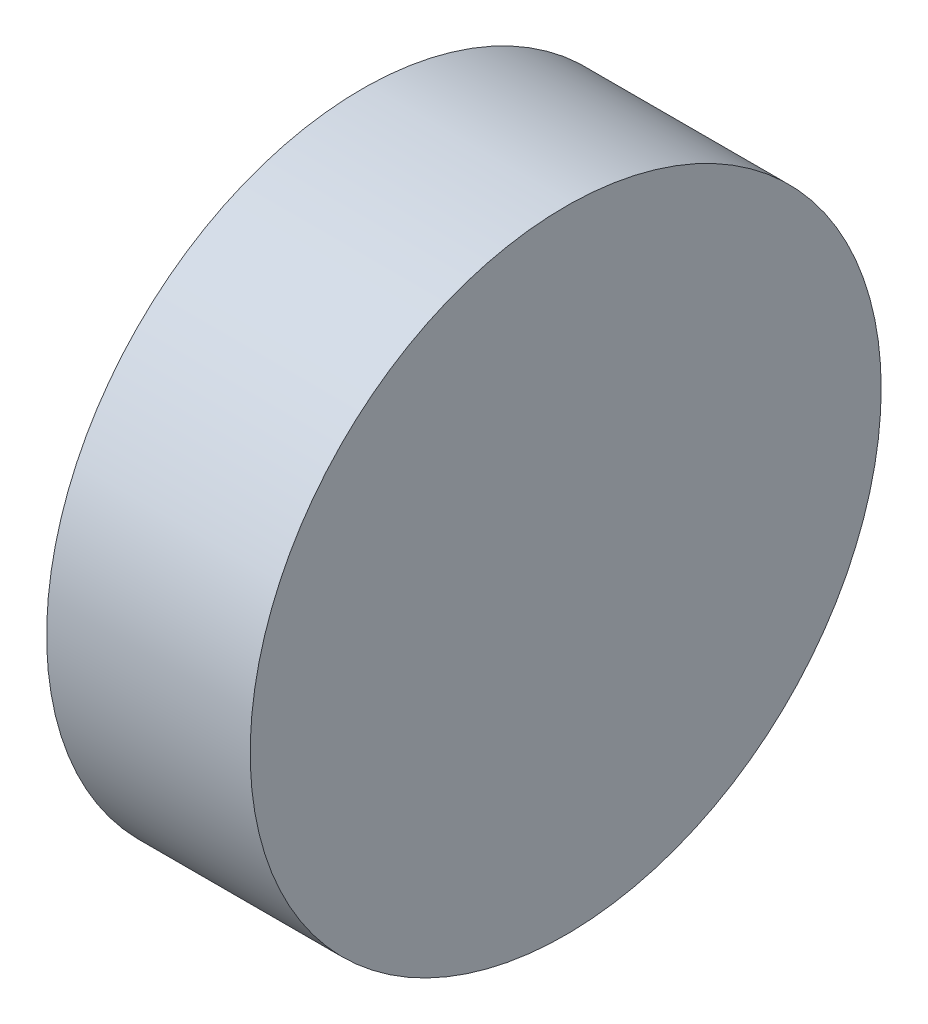
ISO-10303-21;
HEADER;
FILE_DESCRIPTION(('STEP AP214'),'2;1');
FILE_NAME('part.step','',(''),(''),'','','');
FILE_SCHEMA(('AUTOMOTIVE_DESIGN { 1 0 10303 214 1 1 1 1 }'));
ENDSEC;
DATA;
#1=APPLICATION_CONTEXT('core data for automotive mechanical design processes');
#2=APPLICATION_PROTOCOL_DEFINITION('international standard','automotive_design',2000,#1);
#3=PRODUCT_CONTEXT('',#1,'mechanical');
#4=PRODUCT('Part','Part','',(#3));
#5=PRODUCT_RELATED_PRODUCT_CATEGORY('part','',(#4));
#6=PRODUCT_DEFINITION_FORMATION('','',#4);
#7=PRODUCT_DEFINITION_CONTEXT('part definition',#1,'design');
#8=PRODUCT_DEFINITION('design','',#6,#7);
#9=PRODUCT_DEFINITION_SHAPE('','',#8);
#10=(LENGTH_UNIT() NAMED_UNIT(*) SI_UNIT(.MILLI.,.METRE.));
#11=(NAMED_UNIT(*) PLANE_ANGLE_UNIT() SI_UNIT($,.RADIAN.));
#12=(NAMED_UNIT(*) SI_UNIT($,.STERADIAN.) SOLID_ANGLE_UNIT());
#13=UNCERTAINTY_MEASURE_WITH_UNIT(LENGTH_MEASURE(1.E-05),#10,'distance_accuracy_value','');
#14=(GEOMETRIC_REPRESENTATION_CONTEXT(3) GLOBAL_UNCERTAINTY_ASSIGNED_CONTEXT((#13)) GLOBAL_UNIT_ASSIGNED_CONTEXT((#10,
#11,#12)) REPRESENTATION_CONTEXT('',''));
#15=CARTESIAN_POINT('',(0.,0.,0.));
#16=DIRECTION('',(0.,0.,1.));
#17=DIRECTION('',(1.,0.,0.));
#18=AXIS2_PLACEMENT_3D('',#15,#16,#17);
#19=CARTESIAN_POINT('',(2.54,0.,0.));
#20=DIRECTION('',(-1.,0.,0.));
#21=DIRECTION('',(0.,0.,1.));
#22=AXIS2_PLACEMENT_3D('',#19,#20,#21);
#23=CYLINDRICAL_SURFACE('',#22,3.937);
#24=CARTESIAN_POINT('',(2.54,0.,0.));
#25=DIRECTION('',(1.,0.,0.));
#26=DIRECTION('',(0.,0.,-1.));
#27=AXIS2_PLACEMENT_3D('',#24,#25,#26);
#28=CIRCLE('',#27,3.937);
#29=CARTESIAN_POINT('',(2.54,0.,-3.937));
#30=VERTEX_POINT('',#29);
#31=EDGE_CURVE('E10',#30,#30,#28,.T.);
#32=ORIENTED_EDGE('',*,*,#31,.F.);
#33=EDGE_LOOP('',(#32));
#34=FACE_BOUND('',#33,.T.);
#35=CARTESIAN_POINT('',(0.,0.,0.));
#36=DIRECTION('',(1.,0.,0.));
#37=DIRECTION('',(0.,0.,-1.));
#38=AXIS2_PLACEMENT_3D('',#35,#36,#37);
#39=CIRCLE('',#38,3.937);
#40=CARTESIAN_POINT('',(0.,0.,-3.937));
#41=VERTEX_POINT('',#40);
#42=EDGE_CURVE('E40',#41,#41,#39,.T.);
#43=ORIENTED_EDGE('',*,*,#42,.T.);
#44=EDGE_LOOP('',(#43));
#45=FACE_BOUND('',#44,.T.);
#46=ADVANCED_FACE('F37',(#34,#45),#23,.T.);
#47=CARTESIAN_POINT('',(2.54,0.,0.));
#48=DIRECTION('',(1.,0.,0.));
#49=DIRECTION('',(0.,0.,-1.));
#50=AXIS2_PLACEMENT_3D('',#47,#48,#49);
#51=PLANE('',#50);
#52=ORIENTED_EDGE('',*,*,#31,.T.);
#53=EDGE_LOOP('',(#52));
#54=FACE_BOUND('',#53,.T.);
#55=ADVANCED_FACE('F54',(#54),#51,.T.);
#56=CARTESIAN_POINT('',(0.,0.,0.));
#57=DIRECTION('',(1.,0.,0.));
#58=DIRECTION('',(0.,0.,-1.));
#59=AXIS2_PLACEMENT_3D('',#56,#57,#58);
#60=PLANE('',#59);
#61=ORIENTED_EDGE('',*,*,#42,.F.);
#62=EDGE_LOOP('',(#61));
#63=FACE_BOUND('',#62,.T.);
#64=ADVANCED_FACE('F52',(#63),#60,.F.);
#65=CLOSED_SHELL('',(#46,#55,#64));
#66=MANIFOLD_SOLID_BREP('B2',#65);
#67=ADVANCED_BREP_SHAPE_REPRESENTATION('',(#18,#66),#14);
#68=SHAPE_DEFINITION_REPRESENTATION(#9,#67);
ENDSEC;
END-ISO-10303-21;
